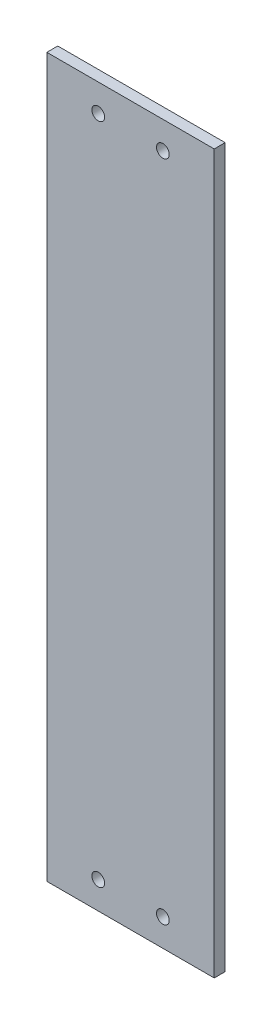
ISO-10303-21;
HEADER;
FILE_DESCRIPTION(('STEP AP214'),'2;1');
FILE_NAME('part.step','',(''),(''),'','','');
FILE_SCHEMA(('AUTOMOTIVE_DESIGN { 1 0 10303 214 1 1 1 1 }'));
ENDSEC;
DATA;
#1=APPLICATION_CONTEXT('core data for automotive mechanical design processes');
#2=APPLICATION_PROTOCOL_DEFINITION('international standard','automotive_design',2000,#1);
#3=PRODUCT_CONTEXT('',#1,'mechanical');
#4=PRODUCT('Part','Part','',(#3));
#5=PRODUCT_RELATED_PRODUCT_CATEGORY('part','',(#4));
#6=PRODUCT_DEFINITION_FORMATION('','',#4);
#7=PRODUCT_DEFINITION_CONTEXT('part definition',#1,'design');
#8=PRODUCT_DEFINITION('design','',#6,#7);
#9=PRODUCT_DEFINITION_SHAPE('','',#8);
#10=(LENGTH_UNIT() NAMED_UNIT(*) SI_UNIT(.MILLI.,.METRE.));
#11=(NAMED_UNIT(*) PLANE_ANGLE_UNIT() SI_UNIT($,.RADIAN.));
#12=(NAMED_UNIT(*) SI_UNIT($,.STERADIAN.) SOLID_ANGLE_UNIT());
#13=UNCERTAINTY_MEASURE_WITH_UNIT(LENGTH_MEASURE(1.E-05),#10,'distance_accuracy_value','');
#14=(GEOMETRIC_REPRESENTATION_CONTEXT(3) GLOBAL_UNCERTAINTY_ASSIGNED_CONTEXT((#13)) GLOBAL_UNIT_ASSIGNED_CONTEXT((#10,
#11,#12)) REPRESENTATION_CONTEXT('',''));
#15=CARTESIAN_POINT('',(0.,0.,0.));
#16=DIRECTION('',(0.,0.,1.));
#17=DIRECTION('',(1.,0.,0.));
#18=AXIS2_PLACEMENT_3D('',#15,#16,#17);
#19=CARTESIAN_POINT('',(-104.87,-9.68399999999956,1.58749999999995));
#20=DIRECTION('',(1.,0.,0.));
#21=DIRECTION('',(0.,0.,-1.));
#22=AXIS2_PLACEMENT_3D('',#19,#20,#21);
#23=PLANE('',#22);
#24=DIRECTION('',(0.,-1.,0.));
#25=VECTOR('',#24,1.);
#26=CARTESIAN_POINT('',(-104.87,-9.68399999999956,0.));
#27=LINE('',#26,#25);
#28=CARTESIAN_POINT('',(-104.87,-9.68399999999956,0.));
#29=VERTEX_POINT('',#28);
#30=CARTESIAN_POINT('',(-104.87,-114.014,0.));
#31=VERTEX_POINT('',#30);
#32=EDGE_CURVE('E101',#29,#31,#27,.T.);
#33=ORIENTED_EDGE('',*,*,#32,.T.);
#34=DIRECTION('',(0.,0.,-1.));
#35=VECTOR('',#34,1.);
#36=CARTESIAN_POINT('',(-104.87,-114.014,1.58749999999995));
#37=LINE('',#36,#35);
#38=CARTESIAN_POINT('',(-104.87,-114.014,1.58749999999995));
#39=VERTEX_POINT('',#38);
#40=EDGE_CURVE('E11',#39,#31,#37,.T.);
#41=ORIENTED_EDGE('',*,*,#40,.F.);
#42=DIRECTION('',(0.,-1.,0.));
#43=VECTOR('',#42,1.);
#44=CARTESIAN_POINT('',(-104.87,-9.68399999999956,1.58749999999995));
#45=LINE('',#44,#43);
#46=CARTESIAN_POINT('',(-104.87,-9.68399999999956,1.58749999999995));
#47=VERTEX_POINT('',#46);
#48=EDGE_CURVE('E89',#47,#39,#45,.T.);
#49=ORIENTED_EDGE('',*,*,#48,.F.);
#50=DIRECTION('',(0.,0.,-1.));
#51=VECTOR('',#50,1.);
#52=CARTESIAN_POINT('',(-104.87,-9.68399999999956,1.58749999999995));
#53=LINE('',#52,#51);
#54=EDGE_CURVE('E97',#47,#29,#53,.T.);
#55=ORIENTED_EDGE('',*,*,#54,.T.);
#56=EDGE_LOOP('',(#33,#41,#49,#55));
#57=FACE_BOUND('',#56,.T.);
#58=ADVANCED_FACE('F38',(#57),#23,.F.);
#59=CARTESIAN_POINT('',(-104.87,-114.014,1.58749999999995));
#60=DIRECTION('',(0.,1.,0.));
#61=DIRECTION('',(0.,0.,1.));
#62=AXIS2_PLACEMENT_3D('',#59,#60,#61);
#63=PLANE('',#62);
#64=DIRECTION('',(1.,0.,0.));
#65=VECTOR('',#64,1.);
#66=CARTESIAN_POINT('',(-104.87,-114.014,0.));
#67=LINE('',#66,#65);
#68=CARTESIAN_POINT('',(-80.5500000000001,-114.014,0.));
#69=VERTEX_POINT('',#68);
#70=EDGE_CURVE('E93',#31,#69,#67,.T.);
#71=ORIENTED_EDGE('',*,*,#70,.T.);
#72=DIRECTION('',(0.,0.,-1.));
#73=VECTOR('',#72,1.);
#74=CARTESIAN_POINT('',(-80.5500000000001,-114.014,1.58749999999995));
#75=LINE('',#74,#73);
#76=CARTESIAN_POINT('',(-80.5500000000001,-114.014,1.58749999999995));
#77=VERTEX_POINT('',#76);
#78=EDGE_CURVE('E46',#77,#69,#75,.T.);
#79=ORIENTED_EDGE('',*,*,#78,.F.);
#80=DIRECTION('',(1.,0.,0.));
#81=VECTOR('',#80,1.);
#82=CARTESIAN_POINT('',(-104.87,-114.014,1.58749999999995));
#83=LINE('',#82,#81);
#84=EDGE_CURVE('E84',#39,#77,#83,.T.);
#85=ORIENTED_EDGE('',*,*,#84,.F.);
#86=ORIENTED_EDGE('',*,*,#40,.T.);
#87=EDGE_LOOP('',(#71,#79,#85,#86));
#88=FACE_BOUND('',#87,.T.);
#89=ADVANCED_FACE('F92',(#88),#63,.F.);
#90=CARTESIAN_POINT('',(-80.5500000000001,-114.014,1.58749999999995));
#91=DIRECTION('',(-1.,0.,0.));
#92=DIRECTION('',(0.,0.,1.));
#93=AXIS2_PLACEMENT_3D('',#90,#91,#92);
#94=PLANE('',#93);
#95=DIRECTION('',(0.,1.,0.));
#96=VECTOR('',#95,1.);
#97=CARTESIAN_POINT('',(-80.5500000000001,-114.014,0.));
#98=LINE('',#97,#96);
#99=CARTESIAN_POINT('',(-80.5500000000001,-9.68399999999956,0.));
#100=VERTEX_POINT('',#99);
#101=EDGE_CURVE('E71',#69,#100,#98,.T.);
#102=ORIENTED_EDGE('',*,*,#101,.T.);
#103=DIRECTION('',(0.,0.,-1.));
#104=VECTOR('',#103,1.);
#105=CARTESIAN_POINT('',(-80.5500000000001,-9.68399999999956,1.58749999999996));
#106=LINE('',#105,#104);
#107=CARTESIAN_POINT('',(-80.5500000000001,-9.68399999999956,1.58749999999996));
#108=VERTEX_POINT('',#107);
#109=EDGE_CURVE('E94',#108,#100,#106,.T.);
#110=ORIENTED_EDGE('',*,*,#109,.F.);
#111=DIRECTION('',(0.,1.,0.));
#112=VECTOR('',#111,1.);
#113=CARTESIAN_POINT('',(-80.5500000000001,-114.014,1.58749999999995));
#114=LINE('',#113,#112);
#115=EDGE_CURVE('E87',#77,#108,#114,.T.);
#116=ORIENTED_EDGE('',*,*,#115,.F.);
#117=ORIENTED_EDGE('',*,*,#78,.T.);
#118=EDGE_LOOP('',(#102,#110,#116,#117));
#119=FACE_BOUND('',#118,.T.);
#120=ADVANCED_FACE('F95',(#119),#94,.F.);
#121=CARTESIAN_POINT('',(-80.5500000000001,-9.68399999999956,1.58749999999996));
#122=DIRECTION('',(0.,-1.,0.));
#123=DIRECTION('',(0.,0.,-1.));
#124=AXIS2_PLACEMENT_3D('',#121,#122,#123);
#125=PLANE('',#124);
#126=DIRECTION('',(-1.,0.,0.));
#127=VECTOR('',#126,1.);
#128=CARTESIAN_POINT('',(-80.5500000000001,-9.68399999999956,0.));
#129=LINE('',#128,#127);
#130=EDGE_CURVE('E77',#100,#29,#129,.T.);
#131=ORIENTED_EDGE('',*,*,#130,.T.);
#132=ORIENTED_EDGE('',*,*,#54,.F.);
#133=DIRECTION('',(-1.,0.,0.));
#134=VECTOR('',#133,1.);
#135=CARTESIAN_POINT('',(-80.5500000000001,-9.68399999999956,1.58749999999996));
#136=LINE('',#135,#134);
#137=EDGE_CURVE('E54',#108,#47,#136,.T.);
#138=ORIENTED_EDGE('',*,*,#137,.F.);
#139=ORIENTED_EDGE('',*,*,#109,.T.);
#140=EDGE_LOOP('',(#131,#132,#138,#139));
#141=FACE_BOUND('',#140,.T.);
#142=ADVANCED_FACE('F109',(#141),#125,.F.);
#143=CARTESIAN_POINT('',(0.,0.,1.58750000000001));
#144=DIRECTION('',(0.,0.,1.));
#145=DIRECTION('',(1.,0.,0.));
#146=AXIS2_PLACEMENT_3D('',#143,#144,#145);
#147=PLANE('',#146);
#148=CARTESIAN_POINT('',(-88.0110000000001,-110.0455,1.58749999999995));
#149=DIRECTION('',(0.,0.,1.));
#150=DIRECTION('',(1.,0.,0.));
#151=AXIS2_PLACEMENT_3D('',#148,#149,#150);
#152=CIRCLE('',#151,0.9271);
#153=CARTESIAN_POINT('',(-87.0839000000001,-110.0455,1.58749999999995));
#154=VERTEX_POINT('',#153);
#155=EDGE_CURVE('E135',#154,#154,#152,.T.);
#156=ORIENTED_EDGE('',*,*,#155,.F.);
#157=EDGE_LOOP('',(#156));
#158=FACE_BOUND('',#157,.T.);
#159=CARTESIAN_POINT('',(-97.4090000000001,-110.0455,1.58749999999995));
#160=DIRECTION('',(0.,0.,1.));
#161=DIRECTION('',(1.,0.,0.));
#162=AXIS2_PLACEMENT_3D('',#159,#160,#161);
#163=CIRCLE('',#162,0.9271);
#164=CARTESIAN_POINT('',(-96.4819000000001,-110.0455,1.58749999999995));
#165=VERTEX_POINT('',#164);
#166=EDGE_CURVE('E129',#165,#165,#163,.T.);
#167=ORIENTED_EDGE('',*,*,#166,.F.);
#168=EDGE_LOOP('',(#167));
#169=FACE_BOUND('',#168,.T.);
#170=CARTESIAN_POINT('',(-88.0110000000001,-13.6525,1.58749999999996));
#171=DIRECTION('',(0.,0.,1.));
#172=DIRECTION('',(1.,0.,0.));
#173=AXIS2_PLACEMENT_3D('',#170,#171,#172);
#174=CIRCLE('',#173,0.9271);
#175=CARTESIAN_POINT('',(-87.0839000000001,-13.6525,1.58749999999996));
#176=VERTEX_POINT('',#175);
#177=EDGE_CURVE('E123',#176,#176,#174,.T.);
#178=ORIENTED_EDGE('',*,*,#177,.F.);
#179=EDGE_LOOP('',(#178));
#180=FACE_BOUND('',#179,.T.);
#181=CARTESIAN_POINT('',(-97.4090000000001,-13.6525,1.58749999999996));
#182=DIRECTION('',(0.,0.,1.));
#183=DIRECTION('',(1.,0.,0.));
#184=AXIS2_PLACEMENT_3D('',#181,#182,#183);
#185=CIRCLE('',#184,0.9271);
#186=CARTESIAN_POINT('',(-96.4819000000001,-13.6525,1.58749999999996));
#187=VERTEX_POINT('',#186);
#188=EDGE_CURVE('E117',#187,#187,#185,.T.);
#189=ORIENTED_EDGE('',*,*,#188,.F.);
#190=EDGE_LOOP('',(#189));
#191=FACE_BOUND('',#190,.T.);
#192=ORIENTED_EDGE('',*,*,#48,.T.);
#193=ORIENTED_EDGE('',*,*,#84,.T.);
#194=ORIENTED_EDGE('',*,*,#115,.T.);
#195=ORIENTED_EDGE('',*,*,#137,.T.);
#196=EDGE_LOOP('',(#192,#193,#194,#195));
#197=FACE_BOUND('',#196,.T.);
#198=ADVANCED_FACE('F85',(#158,#169,#180,#191,#197),#147,.T.);
#199=CARTESIAN_POINT('',(0.,0.,0.));
#200=DIRECTION('',(0.,0.,1.));
#201=DIRECTION('',(1.,0.,0.));
#202=AXIS2_PLACEMENT_3D('',#199,#200,#201);
#203=PLANE('',#202);
#204=CARTESIAN_POINT('',(-88.0110000000001,-110.0455,0.));
#205=DIRECTION('',(0.,0.,1.));
#206=DIRECTION('',(1.,0.,0.));
#207=AXIS2_PLACEMENT_3D('',#204,#205,#206);
#208=CIRCLE('',#207,0.9271);
#209=CARTESIAN_POINT('',(-87.0839000000001,-110.0455,0.));
#210=VERTEX_POINT('',#209);
#211=EDGE_CURVE('E132',#210,#210,#208,.T.);
#212=ORIENTED_EDGE('',*,*,#211,.T.);
#213=EDGE_LOOP('',(#212));
#214=FACE_BOUND('',#213,.T.);
#215=CARTESIAN_POINT('',(-97.4090000000001,-110.0455,0.));
#216=DIRECTION('',(0.,0.,1.));
#217=DIRECTION('',(1.,0.,0.));
#218=AXIS2_PLACEMENT_3D('',#215,#216,#217);
#219=CIRCLE('',#218,0.9271);
#220=CARTESIAN_POINT('',(-96.4819000000001,-110.0455,0.));
#221=VERTEX_POINT('',#220);
#222=EDGE_CURVE('E126',#221,#221,#219,.T.);
#223=ORIENTED_EDGE('',*,*,#222,.T.);
#224=EDGE_LOOP('',(#223));
#225=FACE_BOUND('',#224,.T.);
#226=CARTESIAN_POINT('',(-88.0110000000001,-13.6525,0.));
#227=DIRECTION('',(0.,0.,1.));
#228=DIRECTION('',(1.,0.,0.));
#229=AXIS2_PLACEMENT_3D('',#226,#227,#228);
#230=CIRCLE('',#229,0.9271);
#231=CARTESIAN_POINT('',(-87.0839000000001,-13.6525,0.));
#232=VERTEX_POINT('',#231);
#233=EDGE_CURVE('E120',#232,#232,#230,.T.);
#234=ORIENTED_EDGE('',*,*,#233,.T.);
#235=EDGE_LOOP('',(#234));
#236=FACE_BOUND('',#235,.T.);
#237=CARTESIAN_POINT('',(-97.4090000000001,-13.6525,0.));
#238=DIRECTION('',(0.,0.,1.));
#239=DIRECTION('',(1.,0.,0.));
#240=AXIS2_PLACEMENT_3D('',#237,#238,#239);
#241=CIRCLE('',#240,0.9271);
#242=CARTESIAN_POINT('',(-96.4819000000001,-13.6525,0.));
#243=VERTEX_POINT('',#242);
#244=EDGE_CURVE('E104',#243,#243,#241,.T.);
#245=ORIENTED_EDGE('',*,*,#244,.T.);
#246=EDGE_LOOP('',(#245));
#247=FACE_BOUND('',#246,.T.);
#248=ORIENTED_EDGE('',*,*,#32,.F.);
#249=ORIENTED_EDGE('',*,*,#130,.F.);
#250=ORIENTED_EDGE('',*,*,#101,.F.);
#251=ORIENTED_EDGE('',*,*,#70,.F.);
#252=EDGE_LOOP('',(#248,#249,#250,#251));
#253=FACE_BOUND('',#252,.T.);
#254=ADVANCED_FACE('F112',(#214,#225,#236,#247,#253),#203,.F.);
#255=CARTESIAN_POINT('',(-97.4090000000001,-13.6525,1.58749999999996));
#256=DIRECTION('',(0.,0.,1.));
#257=DIRECTION('',(1.,0.,0.));
#258=AXIS2_PLACEMENT_3D('',#255,#256,#257);
#259=CYLINDRICAL_SURFACE('',#258,0.9271);
#260=ORIENTED_EDGE('',*,*,#244,.F.);
#261=EDGE_LOOP('',(#260));
#262=FACE_BOUND('',#261,.T.);
#263=ORIENTED_EDGE('',*,*,#188,.T.);
#264=EDGE_LOOP('',(#263));
#265=FACE_BOUND('',#264,.T.);
#266=ADVANCED_FACE('F150',(#262,#265),#259,.F.);
#267=CARTESIAN_POINT('',(-88.0110000000001,-13.6525,1.58749999999996));
#268=DIRECTION('',(0.,0.,1.));
#269=DIRECTION('',(1.,0.,0.));
#270=AXIS2_PLACEMENT_3D('',#267,#268,#269);
#271=CYLINDRICAL_SURFACE('',#270,0.9271);
#272=ORIENTED_EDGE('',*,*,#233,.F.);
#273=EDGE_LOOP('',(#272));
#274=FACE_BOUND('',#273,.T.);
#275=ORIENTED_EDGE('',*,*,#177,.T.);
#276=EDGE_LOOP('',(#275));
#277=FACE_BOUND('',#276,.T.);
#278=ADVANCED_FACE('F152',(#274,#277),#271,.F.);
#279=CARTESIAN_POINT('',(-97.4090000000001,-110.0455,1.58749999999995));
#280=DIRECTION('',(0.,0.,1.));
#281=DIRECTION('',(1.,0.,0.));
#282=AXIS2_PLACEMENT_3D('',#279,#280,#281);
#283=CYLINDRICAL_SURFACE('',#282,0.9271);
#284=ORIENTED_EDGE('',*,*,#222,.F.);
#285=EDGE_LOOP('',(#284));
#286=FACE_BOUND('',#285,.T.);
#287=ORIENTED_EDGE('',*,*,#166,.T.);
#288=EDGE_LOOP('',(#287));
#289=FACE_BOUND('',#288,.T.);
#290=ADVANCED_FACE('F159',(#286,#289),#283,.F.);
#291=CARTESIAN_POINT('',(-88.0110000000001,-110.0455,1.58749999999995));
#292=DIRECTION('',(0.,0.,1.));
#293=DIRECTION('',(1.,0.,0.));
#294=AXIS2_PLACEMENT_3D('',#291,#292,#293);
#295=CYLINDRICAL_SURFACE('',#294,0.9271);
#296=ORIENTED_EDGE('',*,*,#211,.F.);
#297=EDGE_LOOP('',(#296));
#298=FACE_BOUND('',#297,.T.);
#299=ORIENTED_EDGE('',*,*,#155,.T.);
#300=EDGE_LOOP('',(#299));
#301=FACE_BOUND('',#300,.T.);
#302=ADVANCED_FACE('F139',(#298,#301),#295,.F.);
#303=CLOSED_SHELL('',(#58,#89,#120,#142,#198,#254,#266,#278,#290,#302));
#304=MANIFOLD_SOLID_BREP('B2',#303);
#305=ADVANCED_BREP_SHAPE_REPRESENTATION('',(#18,#304),#14);
#306=SHAPE_DEFINITION_REPRESENTATION(#9,#305);
ENDSEC;
END-ISO-10303-21;
